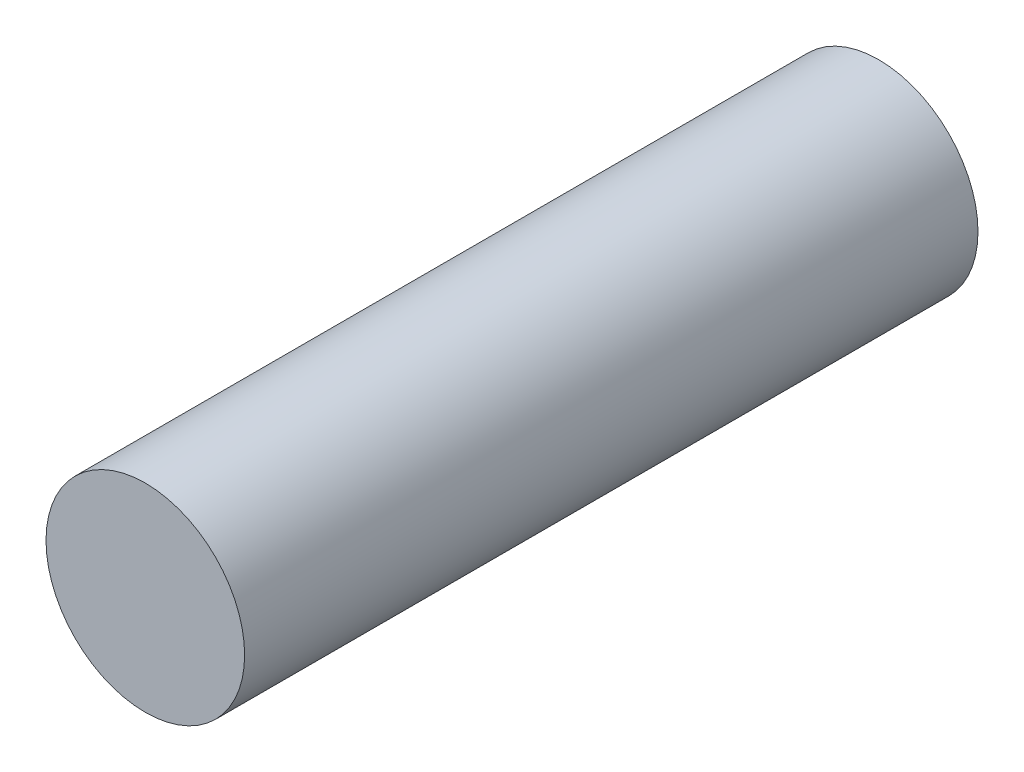
ISO-10303-21;
HEADER;
FILE_DESCRIPTION(('STEP AP214'),'2;1');
FILE_NAME('part.step','',(''),(''),'','','');
FILE_SCHEMA(('AUTOMOTIVE_DESIGN { 1 0 10303 214 1 1 1 1 }'));
ENDSEC;
DATA;
#1=APPLICATION_CONTEXT('core data for automotive mechanical design processes');
#2=APPLICATION_PROTOCOL_DEFINITION('international standard','automotive_design',2000,#1);
#3=PRODUCT_CONTEXT('',#1,'mechanical');
#4=PRODUCT('Part','Part','',(#3));
#5=PRODUCT_RELATED_PRODUCT_CATEGORY('part','',(#4));
#6=PRODUCT_DEFINITION_FORMATION('','',#4);
#7=PRODUCT_DEFINITION_CONTEXT('part definition',#1,'design');
#8=PRODUCT_DEFINITION('design','',#6,#7);
#9=PRODUCT_DEFINITION_SHAPE('','',#8);
#10=(LENGTH_UNIT() NAMED_UNIT(*) SI_UNIT(.MILLI.,.METRE.));
#11=(NAMED_UNIT(*) PLANE_ANGLE_UNIT() SI_UNIT($,.RADIAN.));
#12=(NAMED_UNIT(*) SI_UNIT($,.STERADIAN.) SOLID_ANGLE_UNIT());
#13=UNCERTAINTY_MEASURE_WITH_UNIT(LENGTH_MEASURE(1.E-05),#10,'distance_accuracy_value','');
#14=(GEOMETRIC_REPRESENTATION_CONTEXT(3) GLOBAL_UNCERTAINTY_ASSIGNED_CONTEXT((#13)) GLOBAL_UNIT_ASSIGNED_CONTEXT((#10,
#11,#12)) REPRESENTATION_CONTEXT('',''));
#15=CARTESIAN_POINT('',(0.,0.,0.));
#16=DIRECTION('',(0.,0.,1.));
#17=DIRECTION('',(1.,0.,0.));
#18=AXIS2_PLACEMENT_3D('',#15,#16,#17);
#19=CARTESIAN_POINT('',(0.,0.,24.));
#20=DIRECTION('',(0.,0.,-1.));
#21=DIRECTION('',(-1.,0.,0.));
#22=AXIS2_PLACEMENT_3D('',#19,#20,#21);
#23=CYLINDRICAL_SURFACE('',#22,6.5);
#24=CARTESIAN_POINT('',(0.,0.,24.));
#25=DIRECTION('',(0.,0.,1.));
#26=DIRECTION('',(1.,0.,0.));
#27=AXIS2_PLACEMENT_3D('',#24,#25,#26);
#28=CIRCLE('',#27,6.5);
#29=CARTESIAN_POINT('',(6.5,0.,24.));
#30=VERTEX_POINT('',#29);
#31=EDGE_CURVE('E10',#30,#30,#28,.T.);
#32=ORIENTED_EDGE('',*,*,#31,.F.);
#33=EDGE_LOOP('',(#32));
#34=FACE_BOUND('',#33,.T.);
#35=CARTESIAN_POINT('',(0.,0.,-24.));
#36=DIRECTION('',(0.,0.,1.));
#37=DIRECTION('',(1.,0.,0.));
#38=AXIS2_PLACEMENT_3D('',#35,#36,#37);
#39=CIRCLE('',#38,6.5);
#40=CARTESIAN_POINT('',(6.5,0.,-24.));
#41=VERTEX_POINT('',#40);
#42=EDGE_CURVE('E39',#41,#41,#39,.T.);
#43=ORIENTED_EDGE('',*,*,#42,.T.);
#44=EDGE_LOOP('',(#43));
#45=FACE_BOUND('',#44,.T.);
#46=ADVANCED_FACE('F36',(#34,#45),#23,.T.);
#47=CARTESIAN_POINT('',(0.,0.,24.));
#48=DIRECTION('',(0.,0.,1.));
#49=DIRECTION('',(1.,0.,0.));
#50=AXIS2_PLACEMENT_3D('',#47,#48,#49);
#51=PLANE('',#50);
#52=ORIENTED_EDGE('',*,*,#31,.T.);
#53=EDGE_LOOP('',(#52));
#54=FACE_BOUND('',#53,.T.);
#55=ADVANCED_FACE('F51',(#54),#51,.T.);
#56=CARTESIAN_POINT('',(0.,0.,-24.));
#57=DIRECTION('',(0.,0.,1.));
#58=DIRECTION('',(1.,0.,0.));
#59=AXIS2_PLACEMENT_3D('',#56,#57,#58);
#60=PLANE('',#59);
#61=ORIENTED_EDGE('',*,*,#42,.F.);
#62=EDGE_LOOP('',(#61));
#63=FACE_BOUND('',#62,.T.);
#64=ADVANCED_FACE('F49',(#63),#60,.F.);
#65=CLOSED_SHELL('',(#46,#55,#64));
#66=MANIFOLD_SOLID_BREP('B2',#65);
#67=ADVANCED_BREP_SHAPE_REPRESENTATION('',(#18,#66),#14);
#68=SHAPE_DEFINITION_REPRESENTATION(#9,#67);
ENDSEC;
END-ISO-10303-21;
